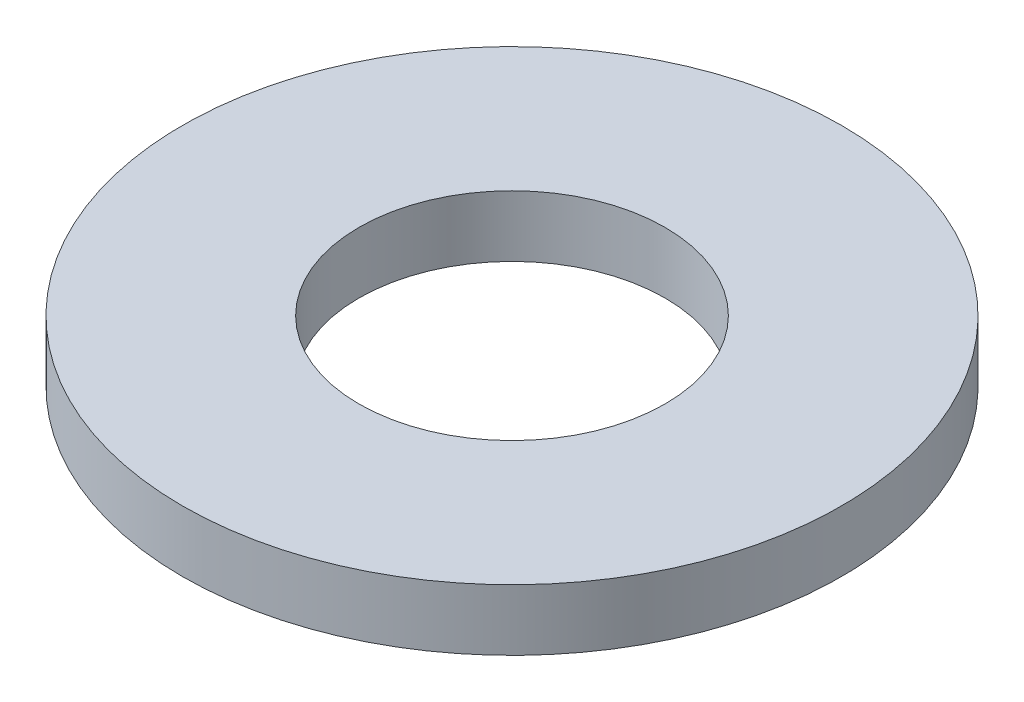
ISO-10303-21;
HEADER;
FILE_DESCRIPTION(('STEP AP214'),'2;1');
FILE_NAME('part.step','',(''),(''),'','','');
FILE_SCHEMA(('AUTOMOTIVE_DESIGN { 1 0 10303 214 1 1 1 1 }'));
ENDSEC;
DATA;
#1=APPLICATION_CONTEXT('core data for automotive mechanical design processes');
#2=APPLICATION_PROTOCOL_DEFINITION('international standard','automotive_design',2000,#1);
#3=PRODUCT_CONTEXT('',#1,'mechanical');
#4=PRODUCT('Part','Part','',(#3));
#5=PRODUCT_RELATED_PRODUCT_CATEGORY('part','',(#4));
#6=PRODUCT_DEFINITION_FORMATION('','',#4);
#7=PRODUCT_DEFINITION_CONTEXT('part definition',#1,'design');
#8=PRODUCT_DEFINITION('design','',#6,#7);
#9=PRODUCT_DEFINITION_SHAPE('','',#8);
#10=(LENGTH_UNIT() NAMED_UNIT(*) SI_UNIT(.MILLI.,.METRE.));
#11=(NAMED_UNIT(*) PLANE_ANGLE_UNIT() SI_UNIT($,.RADIAN.));
#12=(NAMED_UNIT(*) SI_UNIT($,.STERADIAN.) SOLID_ANGLE_UNIT());
#13=UNCERTAINTY_MEASURE_WITH_UNIT(LENGTH_MEASURE(1.E-05),#10,'distance_accuracy_value','');
#14=(GEOMETRIC_REPRESENTATION_CONTEXT(3) GLOBAL_UNCERTAINTY_ASSIGNED_CONTEXT((#13)) GLOBAL_UNIT_ASSIGNED_CONTEXT((#10,
#11,#12)) REPRESENTATION_CONTEXT('',''));
#15=CARTESIAN_POINT('',(0.,0.,0.));
#16=DIRECTION('',(0.,0.,1.));
#17=DIRECTION('',(1.,0.,0.));
#18=AXIS2_PLACEMENT_3D('',#15,#16,#17);
#19=CARTESIAN_POINT('',(0.,13.,0.));
#20=DIRECTION('',(0.,-1.,0.));
#21=DIRECTION('',(0.,0.,-1.));
#22=AXIS2_PLACEMENT_3D('',#19,#20,#21);
#23=CYLINDRICAL_SURFACE('',#22,70.);
#24=CARTESIAN_POINT('',(0.,13.,0.));
#25=DIRECTION('',(0.,1.,0.));
#26=DIRECTION('',(0.,0.,1.));
#27=AXIS2_PLACEMENT_3D('',#24,#25,#26);
#28=CIRCLE('',#27,70.);
#29=CARTESIAN_POINT('',(0.,13.,-70.));
#30=VERTEX_POINT('',#29);
#31=EDGE_CURVE('E10',#30,#30,#28,.T.);
#32=CARTESIAN_POINT('',(0.,0.,0.));
#33=DIRECTION('',(0.,1.,0.));
#34=DIRECTION('',(0.,0.,1.));
#35=AXIS2_PLACEMENT_3D('',#32,#33,#34);
#36=CIRCLE('',#35,70.);
#37=CARTESIAN_POINT('',(0.,0.,-70.));
#38=VERTEX_POINT('',#37);
#39=EDGE_CURVE('E37',#38,#38,#36,.T.);
#40=CARTESIAN_POINT('',(0.,13.,-70.));
#41=CARTESIAN_POINT('',(0.,12.8645833333333,-70.));
#42=CARTESIAN_POINT('',(0.,12.7291666666667,-70.));
#43=CARTESIAN_POINT('',(0.,12.4583333333333,-70.));
#44=CARTESIAN_POINT('',(0.,12.3229166666667,-70.));
#45=CARTESIAN_POINT('',(0.,12.0520833333333,-70.));
#46=CARTESIAN_POINT('',(0.,11.9166666666667,-70.));
#47=CARTESIAN_POINT('',(0.,11.6458333333333,-70.));
#48=CARTESIAN_POINT('',(0.,11.5104166666667,-70.));
#49=CARTESIAN_POINT('',(0.,11.2395833333333,-70.));
#50=CARTESIAN_POINT('',(0.,11.1041666666667,-70.));
#51=CARTESIAN_POINT('',(0.,10.8333333333333,-70.));
#52=CARTESIAN_POINT('',(0.,10.6979166666667,-70.));
#53=CARTESIAN_POINT('',(0.,10.4270833333333,-70.));
#54=CARTESIAN_POINT('',(0.,10.2916666666667,-70.));
#55=CARTESIAN_POINT('',(0.,10.0208333333333,-70.));
#56=CARTESIAN_POINT('',(0.,9.88541666666667,-70.));
#57=CARTESIAN_POINT('',(0.,9.61458333333333,-70.));
#58=CARTESIAN_POINT('',(0.,9.47916666666667,-70.));
#59=CARTESIAN_POINT('',(0.,9.20833333333333,-70.));
#60=CARTESIAN_POINT('',(0.,9.07291666666667,-70.));
#61=CARTESIAN_POINT('',(0.,8.80208333333333,-70.));
#62=CARTESIAN_POINT('',(0.,8.66666666666667,-70.));
#63=CARTESIAN_POINT('',(0.,8.39583333333333,-70.));
#64=CARTESIAN_POINT('',(0.,8.26041666666667,-70.));
#65=CARTESIAN_POINT('',(0.,7.98958333333333,-70.));
#66=CARTESIAN_POINT('',(0.,7.85416666666667,-70.));
#67=CARTESIAN_POINT('',(0.,7.58333333333333,-70.));
#68=CARTESIAN_POINT('',(0.,7.44791666666667,-70.));
#69=CARTESIAN_POINT('',(0.,7.17708333333333,-70.));
#70=CARTESIAN_POINT('',(0.,7.04166666666667,-70.));
#71=CARTESIAN_POINT('',(0.,6.77083333333333,-70.));
#72=CARTESIAN_POINT('',(0.,6.63541666666667,-70.));
#73=CARTESIAN_POINT('',(0.,6.36458333333333,-70.));
#74=CARTESIAN_POINT('',(0.,6.22916666666667,-70.));
#75=CARTESIAN_POINT('',(0.,5.95833333333333,-70.));
#76=CARTESIAN_POINT('',(0.,5.82291666666667,-70.));
#77=CARTESIAN_POINT('',(0.,5.55208333333333,-70.));
#78=CARTESIAN_POINT('',(0.,5.41666666666667,-70.));
#79=CARTESIAN_POINT('',(0.,5.14583333333333,-70.));
#80=CARTESIAN_POINT('',(0.,5.01041666666667,-70.));
#81=CARTESIAN_POINT('',(0.,4.73958333333333,-70.));
#82=CARTESIAN_POINT('',(0.,4.60416666666667,-70.));
#83=CARTESIAN_POINT('',(0.,4.33333333333333,-70.));
#84=CARTESIAN_POINT('',(0.,4.19791666666667,-70.));
#85=CARTESIAN_POINT('',(0.,3.92708333333333,-70.));
#86=CARTESIAN_POINT('',(0.,3.79166666666667,-70.));
#87=CARTESIAN_POINT('',(0.,3.52083333333333,-70.));
#88=CARTESIAN_POINT('',(0.,3.38541666666667,-70.));
#89=CARTESIAN_POINT('',(0.,3.11458333333333,-70.));
#90=CARTESIAN_POINT('',(0.,2.97916666666667,-70.));
#91=CARTESIAN_POINT('',(0.,2.70833333333333,-70.));
#92=CARTESIAN_POINT('',(0.,2.57291666666667,-70.));
#93=CARTESIAN_POINT('',(0.,2.30208333333333,-70.));
#94=CARTESIAN_POINT('',(0.,2.16666666666667,-70.));
#95=CARTESIAN_POINT('',(0.,1.89583333333333,-70.));
#96=CARTESIAN_POINT('',(0.,1.76041666666667,-70.));
#97=CARTESIAN_POINT('',(0.,1.48958333333333,-70.));
#98=CARTESIAN_POINT('',(0.,1.35416666666667,-70.));
#99=CARTESIAN_POINT('',(0.,1.08333333333333,-70.));
#100=CARTESIAN_POINT('',(0.,0.947916666666667,-70.));
#101=CARTESIAN_POINT('',(0.,0.677083333333334,-70.));
#102=CARTESIAN_POINT('',(0.,0.541666666666667,-70.));
#103=CARTESIAN_POINT('',(0.,0.270833333333334,-70.));
#104=CARTESIAN_POINT('',(0.,0.135416666666667,-70.));
#105=CARTESIAN_POINT('',(0.,0.,-70.));
#106=B_SPLINE_CURVE_WITH_KNOTS('',3,(#40,#41,#42,#43,#44,#45,#46,#47,#48,#49,#50,#51,#52,#53,
#54,#55,#56,#57,#58,#59,#60,#61,#62,#63,#64,#65,#66,#67,#68,#69,#70,#71,#72,#73,#74,#75,#76,#77,
#78,#79,#80,#81,#82,#83,#84,#85,#86,#87,#88,#89,#90,#91,#92,#93,#94,#95,#96,#97,#98,#99,#100,
#101,#102,#103,#104,#105),.UNSPECIFIED.,.F.,.F.,(4,2,2,2,2,2,2,2,2,2,2,2,2,2,2,2,2,2,2,2,2,2,2,
2,2,2,2,2,2,2,2,2,4),(0.,0.406249999999999,0.812499999999999,1.21875,1.625,2.03125,2.4375,
2.84375,3.25,3.65625,4.0625,4.46875,4.875,5.28125,5.6875,6.09375,6.5,6.90625,7.3125,7.71875,
8.125,8.53125,8.9375,9.34375,9.75,10.15625,10.5625,10.96875,11.375,11.78125,12.1875,12.59375,
13.),.UNSPECIFIED.);
#107=EDGE_CURVE('BSEAM40',#30,#38,#106,.T.);
#108=ORIENTED_EDGE('',*,*,#31,.F.);
#109=ORIENTED_EDGE('',*,*,#39,.T.);
#110=ORIENTED_EDGE('',*,*,#107,.T.);
#111=ORIENTED_EDGE('',*,*,#107,.F.);
#112=EDGE_LOOP('',(#108,#110,#109,#111));
#113=FACE_BOUND('',#112,.T.);
#114=ADVANCED_FACE('F40',(#113),#23,.T.);
#115=CARTESIAN_POINT('',(0.,13.,0.));
#116=DIRECTION('',(0.,1.,0.));
#117=DIRECTION('',(0.,0.,1.));
#118=AXIS2_PLACEMENT_3D('',#115,#116,#117);
#119=PLANE('',#118);
#120=CARTESIAN_POINT('',(0.,13.,0.));
#121=DIRECTION('',(0.,1.,0.));
#122=DIRECTION('',(0.,0.,1.));
#123=AXIS2_PLACEMENT_3D('',#120,#121,#122);
#124=CIRCLE('',#123,32.5);
#125=CARTESIAN_POINT('',(0.,13.,-32.5));
#126=VERTEX_POINT('',#125);
#127=EDGE_CURVE('E50',#126,#126,#124,.T.);
#128=ORIENTED_EDGE('',*,*,#127,.F.);
#129=EDGE_LOOP('',(#128));
#130=FACE_BOUND('',#129,.T.);
#131=ORIENTED_EDGE('',*,*,#31,.T.);
#132=EDGE_LOOP('',(#131));
#133=FACE_BOUND('',#132,.T.);
#134=ADVANCED_FACE('F59',(#130,#133),#119,.T.);
#135=CARTESIAN_POINT('',(0.,0.,0.));
#136=DIRECTION('',(0.,1.,0.));
#137=DIRECTION('',(0.,0.,1.));
#138=AXIS2_PLACEMENT_3D('',#135,#136,#137);
#139=PLANE('',#138);
#140=CARTESIAN_POINT('',(0.,0.,0.));
#141=DIRECTION('',(0.,1.,0.));
#142=DIRECTION('',(0.,0.,1.));
#143=AXIS2_PLACEMENT_3D('',#140,#141,#142);
#144=CIRCLE('',#143,32.5);
#145=CARTESIAN_POINT('',(0.,0.,-32.5));
#146=VERTEX_POINT('',#145);
#147=EDGE_CURVE('E47',#146,#146,#144,.T.);
#148=ORIENTED_EDGE('',*,*,#147,.T.);
#149=EDGE_LOOP('',(#148));
#150=FACE_BOUND('',#149,.T.);
#151=ORIENTED_EDGE('',*,*,#39,.F.);
#152=EDGE_LOOP('',(#151));
#153=FACE_BOUND('',#152,.T.);
#154=ADVANCED_FACE('F58',(#150,#153),#139,.F.);
#155=CARTESIAN_POINT('',(0.,13.,0.));
#156=DIRECTION('',(0.,-1.,0.));
#157=DIRECTION('',(0.,0.,-1.));
#158=AXIS2_PLACEMENT_3D('',#155,#156,#157);
#159=CYLINDRICAL_SURFACE('',#158,32.5);
#160=CARTESIAN_POINT('',(0.,13.,-32.5));
#161=CARTESIAN_POINT('',(0.,12.8645833333333,-32.5));
#162=CARTESIAN_POINT('',(0.,12.7291666666667,-32.5));
#163=CARTESIAN_POINT('',(0.,12.4583333333333,-32.5));
#164=CARTESIAN_POINT('',(0.,12.3229166666667,-32.5));
#165=CARTESIAN_POINT('',(0.,12.0520833333333,-32.5));
#166=CARTESIAN_POINT('',(0.,11.9166666666667,-32.5));
#167=CARTESIAN_POINT('',(0.,11.6458333333333,-32.5));
#168=CARTESIAN_POINT('',(0.,11.5104166666667,-32.5));
#169=CARTESIAN_POINT('',(0.,11.2395833333333,-32.5));
#170=CARTESIAN_POINT('',(0.,11.1041666666667,-32.5));
#171=CARTESIAN_POINT('',(0.,10.8333333333333,-32.5));
#172=CARTESIAN_POINT('',(0.,10.6979166666667,-32.5));
#173=CARTESIAN_POINT('',(0.,10.4270833333333,-32.5));
#174=CARTESIAN_POINT('',(0.,10.2916666666667,-32.5));
#175=CARTESIAN_POINT('',(0.,10.0208333333333,-32.5));
#176=CARTESIAN_POINT('',(0.,9.88541666666667,-32.5));
#177=CARTESIAN_POINT('',(0.,9.61458333333333,-32.5));
#178=CARTESIAN_POINT('',(0.,9.47916666666667,-32.5));
#179=CARTESIAN_POINT('',(0.,9.20833333333333,-32.5));
#180=CARTESIAN_POINT('',(0.,9.07291666666667,-32.5));
#181=CARTESIAN_POINT('',(0.,8.80208333333333,-32.5));
#182=CARTESIAN_POINT('',(0.,8.66666666666667,-32.5));
#183=CARTESIAN_POINT('',(0.,8.39583333333333,-32.5));
#184=CARTESIAN_POINT('',(0.,8.26041666666667,-32.5));
#185=CARTESIAN_POINT('',(0.,7.98958333333333,-32.5));
#186=CARTESIAN_POINT('',(0.,7.85416666666667,-32.5));
#187=CARTESIAN_POINT('',(0.,7.58333333333333,-32.5));
#188=CARTESIAN_POINT('',(0.,7.44791666666667,-32.5));
#189=CARTESIAN_POINT('',(0.,7.17708333333333,-32.5));
#190=CARTESIAN_POINT('',(0.,7.04166666666667,-32.5));
#191=CARTESIAN_POINT('',(0.,6.77083333333333,-32.5));
#192=CARTESIAN_POINT('',(0.,6.63541666666667,-32.5));
#193=CARTESIAN_POINT('',(0.,6.36458333333333,-32.5));
#194=CARTESIAN_POINT('',(0.,6.22916666666667,-32.5));
#195=CARTESIAN_POINT('',(0.,5.95833333333333,-32.5));
#196=CARTESIAN_POINT('',(0.,5.82291666666667,-32.5));
#197=CARTESIAN_POINT('',(0.,5.55208333333333,-32.5));
#198=CARTESIAN_POINT('',(0.,5.41666666666667,-32.5));
#199=CARTESIAN_POINT('',(0.,5.14583333333333,-32.5));
#200=CARTESIAN_POINT('',(0.,5.01041666666667,-32.5));
#201=CARTESIAN_POINT('',(0.,4.73958333333333,-32.5));
#202=CARTESIAN_POINT('',(0.,4.60416666666667,-32.5));
#203=CARTESIAN_POINT('',(0.,4.33333333333333,-32.5));
#204=CARTESIAN_POINT('',(0.,4.19791666666667,-32.5));
#205=CARTESIAN_POINT('',(0.,3.92708333333333,-32.5));
#206=CARTESIAN_POINT('',(0.,3.79166666666667,-32.5));
#207=CARTESIAN_POINT('',(0.,3.52083333333333,-32.5));
#208=CARTESIAN_POINT('',(0.,3.38541666666667,-32.5));
#209=CARTESIAN_POINT('',(0.,3.11458333333333,-32.5));
#210=CARTESIAN_POINT('',(0.,2.97916666666667,-32.5));
#211=CARTESIAN_POINT('',(0.,2.70833333333333,-32.5));
#212=CARTESIAN_POINT('',(0.,2.57291666666667,-32.5));
#213=CARTESIAN_POINT('',(0.,2.30208333333333,-32.5));
#214=CARTESIAN_POINT('',(0.,2.16666666666667,-32.5));
#215=CARTESIAN_POINT('',(0.,1.89583333333333,-32.5));
#216=CARTESIAN_POINT('',(0.,1.76041666666667,-32.5));
#217=CARTESIAN_POINT('',(0.,1.48958333333333,-32.5));
#218=CARTESIAN_POINT('',(0.,1.35416666666667,-32.5));
#219=CARTESIAN_POINT('',(0.,1.08333333333333,-32.5));
#220=CARTESIAN_POINT('',(0.,0.947916666666667,-32.5));
#221=CARTESIAN_POINT('',(0.,0.677083333333334,-32.5));
#222=CARTESIAN_POINT('',(0.,0.541666666666667,-32.5));
#223=CARTESIAN_POINT('',(0.,0.270833333333334,-32.5));
#224=CARTESIAN_POINT('',(0.,0.135416666666667,-32.5));
#225=CARTESIAN_POINT('',(0.,0.,-32.5));
#226=B_SPLINE_CURVE_WITH_KNOTS('',3,(#160,#161,#162,#163,#164,#165,#166,#167,#168,#169,#170,
#171,#172,#173,#174,#175,#176,#177,#178,#179,#180,#181,#182,#183,#184,#185,#186,#187,#188,#189,
#190,#191,#192,#193,#194,#195,#196,#197,#198,#199,#200,#201,#202,#203,#204,#205,#206,#207,#208,
#209,#210,#211,#212,#213,#214,#215,#216,#217,#218,#219,#220,#221,#222,#223,#224,#225),
.UNSPECIFIED.,.F.,.F.,(4,2,2,2,2,2,2,2,2,2,2,2,2,2,2,2,2,2,2,2,2,2,2,2,2,2,2,2,2,2,2,2,4),(0.,
0.406249999999999,0.812499999999999,1.21875,1.625,2.03125,2.4375,2.84375,3.25,3.65625,4.0625,
4.46875,4.875,5.28125,5.6875,6.09375,6.5,6.90625,7.3125,7.71875,8.125,8.53125,8.9375,9.34375,
9.75,10.15625,10.5625,10.96875,11.375,11.78125,12.1875,12.59375,13.),.UNSPECIFIED.);
#227=EDGE_CURVE('BSEAM54',#126,#146,#226,.T.);
#228=ORIENTED_EDGE('',*,*,#127,.T.);
#229=ORIENTED_EDGE('',*,*,#147,.F.);
#230=ORIENTED_EDGE('',*,*,#227,.T.);
#231=ORIENTED_EDGE('',*,*,#227,.F.);
#232=EDGE_LOOP('',(#228,#230,#229,#231));
#233=FACE_BOUND('',#232,.T.);
#234=ADVANCED_FACE('F54',(#233),#159,.F.);
#235=CLOSED_SHELL('',(#114,#134,#154,#234));
#236=MANIFOLD_SOLID_BREP('B2',#235);
#237=ADVANCED_BREP_SHAPE_REPRESENTATION('',(#18,#236),#14);
#238=SHAPE_DEFINITION_REPRESENTATION(#9,#237);
ENDSEC;
END-ISO-10303-21;
